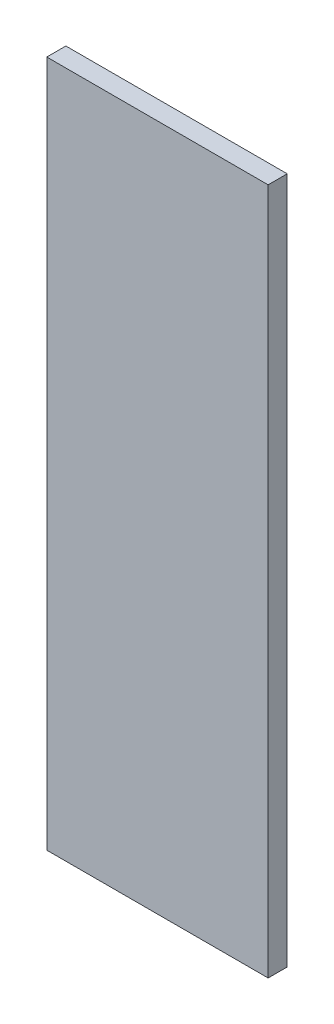
ISO-10303-21;
HEADER;
FILE_DESCRIPTION(('STEP AP214'),'2;1');
FILE_NAME('part.step','',(''),(''),'','','');
FILE_SCHEMA(('AUTOMOTIVE_DESIGN { 1 0 10303 214 1 1 1 1 }'));
ENDSEC;
DATA;
#1=APPLICATION_CONTEXT('core data for automotive mechanical design processes');
#2=APPLICATION_PROTOCOL_DEFINITION('international standard','automotive_design',2000,#1);
#3=PRODUCT_CONTEXT('',#1,'mechanical');
#4=PRODUCT('Part','Part','',(#3));
#5=PRODUCT_RELATED_PRODUCT_CATEGORY('part','',(#4));
#6=PRODUCT_DEFINITION_FORMATION('','',#4);
#7=PRODUCT_DEFINITION_CONTEXT('part definition',#1,'design');
#8=PRODUCT_DEFINITION('design','',#6,#7);
#9=PRODUCT_DEFINITION_SHAPE('','',#8);
#10=(LENGTH_UNIT() NAMED_UNIT(*) SI_UNIT(.MILLI.,.METRE.));
#11=(NAMED_UNIT(*) PLANE_ANGLE_UNIT() SI_UNIT($,.RADIAN.));
#12=(NAMED_UNIT(*) SI_UNIT($,.STERADIAN.) SOLID_ANGLE_UNIT());
#13=UNCERTAINTY_MEASURE_WITH_UNIT(LENGTH_MEASURE(1.E-05),#10,'distance_accuracy_value','');
#14=(GEOMETRIC_REPRESENTATION_CONTEXT(3) GLOBAL_UNCERTAINTY_ASSIGNED_CONTEXT((#13)) GLOBAL_UNIT_ASSIGNED_CONTEXT((#10,
#11,#12)) REPRESENTATION_CONTEXT('',''));
#15=CARTESIAN_POINT('',(0.,0.,0.));
#16=DIRECTION('',(0.,0.,1.));
#17=DIRECTION('',(1.,0.,0.));
#18=AXIS2_PLACEMENT_3D('',#15,#16,#17);
#19=CARTESIAN_POINT('',(58.,0.,5.));
#20=DIRECTION('',(0.,1.,0.));
#21=DIRECTION('',(0.,0.,1.));
#22=AXIS2_PLACEMENT_3D('',#19,#20,#21);
#23=PLANE('',#22);
#24=DIRECTION('',(1.,0.,0.));
#25=VECTOR('',#24,1.);
#26=CARTESIAN_POINT('',(58.,0.,0.));
#27=LINE('',#26,#25);
#28=CARTESIAN_POINT('',(0.,0.,0.));
#29=VERTEX_POINT('',#28);
#30=CARTESIAN_POINT('',(58.,0.,0.));
#31=VERTEX_POINT('',#30);
#32=EDGE_CURVE('E96',#29,#31,#27,.T.);
#33=ORIENTED_EDGE('',*,*,#32,.T.);
#34=DIRECTION('',(0.,0.,-1.));
#35=VECTOR('',#34,1.);
#36=CARTESIAN_POINT('',(58.,0.,5.));
#37=LINE('',#36,#35);
#38=CARTESIAN_POINT('',(58.,0.,5.));
#39=VERTEX_POINT('',#38);
#40=EDGE_CURVE('E11',#39,#31,#37,.T.);
#41=ORIENTED_EDGE('',*,*,#40,.F.);
#42=DIRECTION('',(1.,0.,0.));
#43=VECTOR('',#42,1.);
#44=CARTESIAN_POINT('',(58.,0.,5.));
#45=LINE('',#44,#43);
#46=CARTESIAN_POINT('',(0.,0.,5.));
#47=VERTEX_POINT('',#46);
#48=EDGE_CURVE('E84',#47,#39,#45,.T.);
#49=ORIENTED_EDGE('',*,*,#48,.F.);
#50=DIRECTION('',(0.,0.,-1.));
#51=VECTOR('',#50,1.);
#52=CARTESIAN_POINT('',(0.,0.,5.));
#53=LINE('',#52,#51);
#54=EDGE_CURVE('E92',#47,#29,#53,.T.);
#55=ORIENTED_EDGE('',*,*,#54,.T.);
#56=EDGE_LOOP('',(#33,#41,#49,#55));
#57=FACE_BOUND('',#56,.T.);
#58=ADVANCED_FACE('F33',(#57),#23,.F.);
#59=CARTESIAN_POINT('',(58.,180.,5.));
#60=DIRECTION('',(-1.,0.,0.));
#61=DIRECTION('',(0.,-1.,0.));
#62=AXIS2_PLACEMENT_3D('',#59,#60,#61);
#63=PLANE('',#62);
#64=DIRECTION('',(0.,1.,0.));
#65=VECTOR('',#64,1.);
#66=CARTESIAN_POINT('',(58.,180.,0.));
#67=LINE('',#66,#65);
#68=CARTESIAN_POINT('',(58.,180.,0.));
#69=VERTEX_POINT('',#68);
#70=EDGE_CURVE('E88',#31,#69,#67,.T.);
#71=ORIENTED_EDGE('',*,*,#70,.T.);
#72=DIRECTION('',(0.,0.,-1.));
#73=VECTOR('',#72,1.);
#74=CARTESIAN_POINT('',(58.,180.,5.));
#75=LINE('',#74,#73);
#76=CARTESIAN_POINT('',(58.,180.,5.));
#77=VERTEX_POINT('',#76);
#78=EDGE_CURVE('E41',#77,#69,#75,.T.);
#79=ORIENTED_EDGE('',*,*,#78,.F.);
#80=DIRECTION('',(0.,1.,0.));
#81=VECTOR('',#80,1.);
#82=CARTESIAN_POINT('',(58.,180.,5.));
#83=LINE('',#82,#81);
#84=EDGE_CURVE('E79',#39,#77,#83,.T.);
#85=ORIENTED_EDGE('',*,*,#84,.F.);
#86=ORIENTED_EDGE('',*,*,#40,.T.);
#87=EDGE_LOOP('',(#71,#79,#85,#86));
#88=FACE_BOUND('',#87,.T.);
#89=ADVANCED_FACE('F87',(#88),#63,.F.);
#90=CARTESIAN_POINT('',(0.,180.,5.));
#91=DIRECTION('',(0.,-1.,0.));
#92=DIRECTION('',(0.,0.,-1.));
#93=AXIS2_PLACEMENT_3D('',#90,#91,#92);
#94=PLANE('',#93);
#95=DIRECTION('',(-1.,0.,0.));
#96=VECTOR('',#95,1.);
#97=CARTESIAN_POINT('',(0.,180.,0.));
#98=LINE('',#97,#96);
#99=CARTESIAN_POINT('',(0.,180.,0.));
#100=VERTEX_POINT('',#99);
#101=EDGE_CURVE('E66',#69,#100,#98,.T.);
#102=ORIENTED_EDGE('',*,*,#101,.T.);
#103=DIRECTION('',(0.,0.,-1.));
#104=VECTOR('',#103,1.);
#105=CARTESIAN_POINT('',(0.,180.,5.));
#106=LINE('',#105,#104);
#107=CARTESIAN_POINT('',(0.,180.,5.));
#108=VERTEX_POINT('',#107);
#109=EDGE_CURVE('E89',#108,#100,#106,.T.);
#110=ORIENTED_EDGE('',*,*,#109,.F.);
#111=DIRECTION('',(-1.,0.,0.));
#112=VECTOR('',#111,1.);
#113=CARTESIAN_POINT('',(0.,180.,5.));
#114=LINE('',#113,#112);
#115=EDGE_CURVE('E82',#77,#108,#114,.T.);
#116=ORIENTED_EDGE('',*,*,#115,.F.);
#117=ORIENTED_EDGE('',*,*,#78,.T.);
#118=EDGE_LOOP('',(#102,#110,#116,#117));
#119=FACE_BOUND('',#118,.T.);
#120=ADVANCED_FACE('F90',(#119),#94,.F.);
#121=CARTESIAN_POINT('',(0.,0.,5.));
#122=DIRECTION('',(1.,0.,0.));
#123=DIRECTION('',(0.,0.,-1.));
#124=AXIS2_PLACEMENT_3D('',#121,#122,#123);
#125=PLANE('',#124);
#126=DIRECTION('',(0.,-1.,0.));
#127=VECTOR('',#126,1.);
#128=CARTESIAN_POINT('',(0.,0.,0.));
#129=LINE('',#128,#127);
#130=EDGE_CURVE('E72',#100,#29,#129,.T.);
#131=ORIENTED_EDGE('',*,*,#130,.T.);
#132=ORIENTED_EDGE('',*,*,#54,.F.);
#133=DIRECTION('',(0.,-1.,0.));
#134=VECTOR('',#133,1.);
#135=CARTESIAN_POINT('',(0.,0.,5.));
#136=LINE('',#135,#134);
#137=EDGE_CURVE('E49',#108,#47,#136,.T.);
#138=ORIENTED_EDGE('',*,*,#137,.F.);
#139=ORIENTED_EDGE('',*,*,#109,.T.);
#140=EDGE_LOOP('',(#131,#132,#138,#139));
#141=FACE_BOUND('',#140,.T.);
#142=ADVANCED_FACE('F103',(#141),#125,.F.);
#143=CARTESIAN_POINT('',(0.,0.,5.));
#144=DIRECTION('',(0.,0.,-1.));
#145=DIRECTION('',(-1.,0.,0.));
#146=AXIS2_PLACEMENT_3D('',#143,#144,#145);
#147=PLANE('',#146);
#148=ORIENTED_EDGE('',*,*,#48,.T.);
#149=ORIENTED_EDGE('',*,*,#84,.T.);
#150=ORIENTED_EDGE('',*,*,#115,.T.);
#151=ORIENTED_EDGE('',*,*,#137,.T.);
#152=EDGE_LOOP('',(#148,#149,#150,#151));
#153=FACE_BOUND('',#152,.T.);
#154=ADVANCED_FACE('F80',(#153),#147,.F.);
#155=CARTESIAN_POINT('',(0.,0.,0.));
#156=DIRECTION('',(0.,0.,-1.));
#157=DIRECTION('',(-1.,0.,0.));
#158=AXIS2_PLACEMENT_3D('',#155,#156,#157);
#159=PLANE('',#158);
#160=ORIENTED_EDGE('',*,*,#32,.F.);
#161=ORIENTED_EDGE('',*,*,#130,.F.);
#162=ORIENTED_EDGE('',*,*,#101,.F.);
#163=ORIENTED_EDGE('',*,*,#70,.F.);
#164=EDGE_LOOP('',(#160,#161,#162,#163));
#165=FACE_BOUND('',#164,.T.);
#166=ADVANCED_FACE('F106',(#165),#159,.T.);
#167=CLOSED_SHELL('',(#58,#89,#120,#142,#154,#166));
#168=MANIFOLD_SOLID_BREP('B2',#167);
#169=ADVANCED_BREP_SHAPE_REPRESENTATION('',(#18,#168),#14);
#170=SHAPE_DEFINITION_REPRESENTATION(#9,#169);
ENDSEC;
END-ISO-10303-21;
